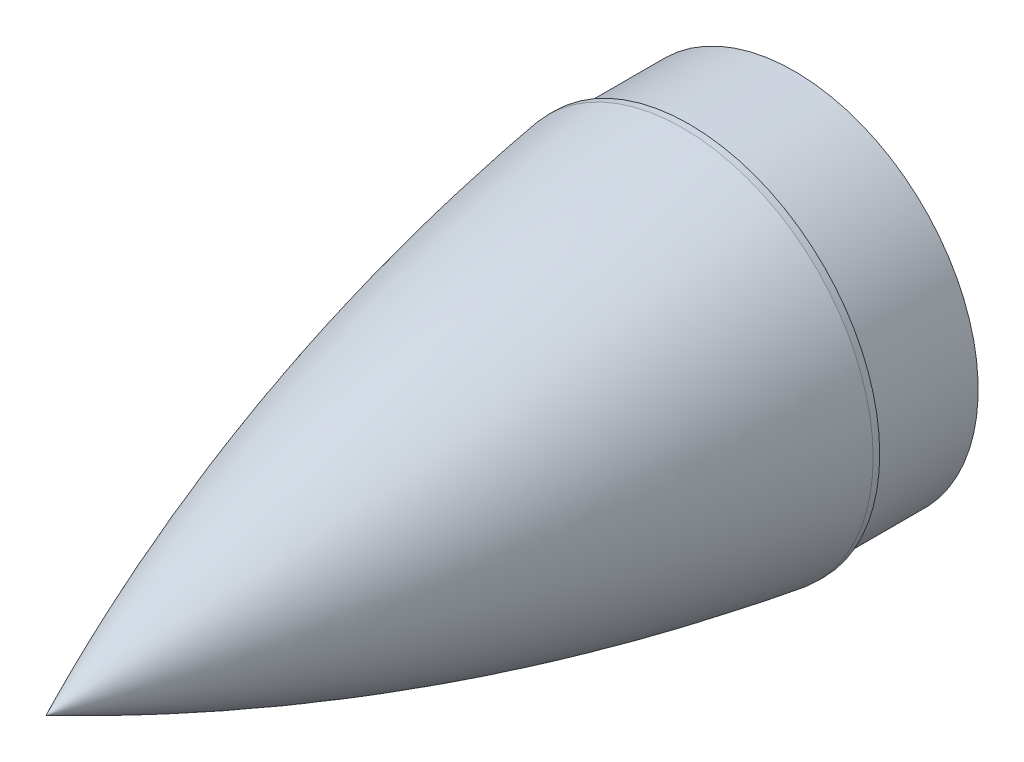
ISO-10303-21;
HEADER;
FILE_DESCRIPTION(('STEP AP214'),'2;1');
FILE_NAME('part.step','',(''),(''),'','','');
FILE_SCHEMA(('AUTOMOTIVE_DESIGN { 1 0 10303 214 1 1 1 1 }'));
ENDSEC;
DATA;
#1=APPLICATION_CONTEXT('core data for automotive mechanical design processes');
#2=APPLICATION_PROTOCOL_DEFINITION('international standard','automotive_design',2000,#1);
#3=PRODUCT_CONTEXT('',#1,'mechanical');
#4=PRODUCT('Part','Part','',(#3));
#5=PRODUCT_RELATED_PRODUCT_CATEGORY('part','',(#4));
#6=PRODUCT_DEFINITION_FORMATION('','',#4);
#7=PRODUCT_DEFINITION_CONTEXT('part definition',#1,'design');
#8=PRODUCT_DEFINITION('design','',#6,#7);
#9=PRODUCT_DEFINITION_SHAPE('','',#8);
#10=(LENGTH_UNIT() NAMED_UNIT(*) SI_UNIT(.MILLI.,.METRE.));
#11=(NAMED_UNIT(*) PLANE_ANGLE_UNIT() SI_UNIT($,.RADIAN.));
#12=(NAMED_UNIT(*) SI_UNIT($,.STERADIAN.) SOLID_ANGLE_UNIT());
#13=UNCERTAINTY_MEASURE_WITH_UNIT(LENGTH_MEASURE(1.E-05),#10,'distance_accuracy_value','');
#14=(GEOMETRIC_REPRESENTATION_CONTEXT(3) GLOBAL_UNCERTAINTY_ASSIGNED_CONTEXT((#13)) GLOBAL_UNIT_ASSIGNED_CONTEXT((#10,
#11,#12)) REPRESENTATION_CONTEXT('',''));
#15=CARTESIAN_POINT('',(0.,0.,0.));
#16=DIRECTION('',(0.,0.,1.));
#17=DIRECTION('',(1.,0.,0.));
#18=AXIS2_PLACEMENT_3D('',#15,#16,#17);
#19=CARTESIAN_POINT('',(0.,0.,-3.175));
#20=DIRECTION('',(0.,0.,1.));
#21=DIRECTION('',(1.,0.,0.));
#22=AXIS2_PLACEMENT_3D('',#19,#20,#21);
#23=CYLINDRICAL_SURFACE('',#22,92.075);
#24=CARTESIAN_POINT('',(0.,0.,-3.175));
#25=DIRECTION('',(0.,0.,1.));
#26=DIRECTION('',(1.,0.,0.));
#27=AXIS2_PLACEMENT_3D('',#24,#25,#26);
#28=CIRCLE('',#27,92.075);
#29=CARTESIAN_POINT('',(92.075,0.,-3.175));
#30=VERTEX_POINT('',#29);
#31=EDGE_CURVE('E93',#30,#30,#28,.T.);
#32=ORIENTED_EDGE('',*,*,#31,.T.);
#33=EDGE_LOOP('',(#32));
#34=FACE_BOUND('',#33,.T.);
#35=CARTESIAN_POINT('',(0.,0.,0.));
#36=DIRECTION('',(0.,0.,1.));
#37=DIRECTION('',(1.,0.,0.));
#38=AXIS2_PLACEMENT_3D('',#35,#36,#37);
#39=CIRCLE('',#38,92.075);
#40=CARTESIAN_POINT('',(92.075,0.,0.));
#41=VERTEX_POINT('',#40);
#42=EDGE_CURVE('E90',#41,#41,#39,.T.);
#43=ORIENTED_EDGE('',*,*,#42,.F.);
#44=EDGE_LOOP('',(#43));
#45=FACE_BOUND('',#44,.T.);
#46=ADVANCED_FACE('F36',(#34,#45),#23,.T.);
#47=CARTESIAN_POINT('',(0.,0.,-3.175));
#48=DIRECTION('',(0.,0.,1.));
#49=DIRECTION('',(1.,0.,0.));
#50=AXIS2_PLACEMENT_3D('',#47,#48,#49);
#51=PLANE('',#50);
#52=CARTESIAN_POINT('',(0.,0.,-3.175));
#53=DIRECTION('',(0.,0.,-1.));
#54=DIRECTION('',(-1.,0.,0.));
#55=AXIS2_PLACEMENT_3D('',#52,#53,#54);
#56=CIRCLE('',#55,88.9);
#57=CARTESIAN_POINT('',(-88.9,0.,-3.175));
#58=VERTEX_POINT('',#57);
#59=EDGE_CURVE('E44',#58,#58,#56,.T.);
#60=ORIENTED_EDGE('',*,*,#59,.F.);
#61=EDGE_LOOP('',(#60));
#62=FACE_BOUND('',#61,.T.);
#63=ORIENTED_EDGE('',*,*,#31,.F.);
#64=EDGE_LOOP('',(#63));
#65=FACE_BOUND('',#64,.T.);
#66=ADVANCED_FACE('F100',(#62,#65),#51,.F.);
#67=CARTESIAN_POINT('',(0.,0.,-53.975));
#68=DIRECTION('',(0.,0.,1.));
#69=DIRECTION('',(1.,0.,0.));
#70=AXIS2_PLACEMENT_3D('',#67,#68,#69);
#71=CYLINDRICAL_SURFACE('',#70,88.9);
#72=CARTESIAN_POINT('',(0.,0.,-53.975));
#73=DIRECTION('',(0.,0.,-1.));
#74=DIRECTION('',(-1.,0.,0.));
#75=AXIS2_PLACEMENT_3D('',#72,#73,#74);
#76=CIRCLE('',#75,88.9);
#77=CARTESIAN_POINT('',(-88.9,0.,-53.975));
#78=VERTEX_POINT('',#77);
#79=EDGE_CURVE('E84',#78,#78,#76,.T.);
#80=ORIENTED_EDGE('',*,*,#79,.F.);
#81=EDGE_LOOP('',(#80));
#82=FACE_BOUND('',#81,.T.);
#83=ORIENTED_EDGE('',*,*,#59,.T.);
#84=EDGE_LOOP('',(#83));
#85=FACE_BOUND('',#84,.T.);
#86=ADVANCED_FACE('F105',(#82,#85),#71,.T.);
#87=CARTESIAN_POINT('',(0.,0.,-53.975));
#88=DIRECTION('',(0.,0.,-1.));
#89=DIRECTION('',(-1.,0.,0.));
#90=AXIS2_PLACEMENT_3D('',#87,#88,#89);
#91=PLANE('',#90);
#92=CARTESIAN_POINT('',(0.,0.,-53.975));
#93=DIRECTION('',(0.,0.,-1.));
#94=DIRECTION('',(-1.,0.,0.));
#95=AXIS2_PLACEMENT_3D('',#92,#93,#94);
#96=CIRCLE('',#95,85.725);
#97=CARTESIAN_POINT('',(-85.725,0.,-53.975));
#98=VERTEX_POINT('',#97);
#99=EDGE_CURVE('E85',#98,#98,#96,.T.);
#100=ORIENTED_EDGE('',*,*,#99,.F.);
#101=EDGE_LOOP('',(#100));
#102=FACE_BOUND('',#101,.T.);
#103=ORIENTED_EDGE('',*,*,#79,.T.);
#104=EDGE_LOOP('',(#103));
#105=FACE_BOUND('',#104,.T.);
#106=ADVANCED_FACE('F113',(#102,#105),#91,.T.);
#107=CARTESIAN_POINT('',(0.,0.,-3.175));
#108=DIRECTION('',(0.,0.,-1.));
#109=DIRECTION('',(-1.,0.,0.));
#110=AXIS2_PLACEMENT_3D('',#107,#108,#109);
#111=CYLINDRICAL_SURFACE('',#110,85.725);
#112=CARTESIAN_POINT('',(0.,0.,-3.175));
#113=DIRECTION('',(0.,0.,-1.));
#114=DIRECTION('',(-1.,0.,0.));
#115=AXIS2_PLACEMENT_3D('',#112,#113,#114);
#116=CIRCLE('',#115,85.725);
#117=CARTESIAN_POINT('',(-85.725,0.,-3.175));
#118=VERTEX_POINT('',#117);
#119=EDGE_CURVE('E78',#118,#118,#116,.T.);
#120=ORIENTED_EDGE('',*,*,#119,.F.);
#121=EDGE_LOOP('',(#120));
#122=FACE_BOUND('',#121,.T.);
#123=ORIENTED_EDGE('',*,*,#99,.T.);
#124=EDGE_LOOP('',(#123));
#125=FACE_BOUND('',#124,.T.);
#126=ADVANCED_FACE('F119',(#122,#125),#111,.F.);
#127=CARTESIAN_POINT('',(0.,0.,-3.175));
#128=DIRECTION('',(0.,0.,-1.));
#129=DIRECTION('',(-1.,0.,0.));
#130=AXIS2_PLACEMENT_3D('',#127,#128,#129);
#131=PLANE('',#130);
#132=ORIENTED_EDGE('',*,*,#119,.T.);
#133=EDGE_LOOP('',(#132));
#134=FACE_BOUND('',#133,.T.);
#135=ADVANCED_FACE('F66',(#134),#131,.T.);
#136=CARTESIAN_POINT('',(0.,0.,307.975));
#137=CARTESIAN_POINT('',(68.5382612762219,0.,160.14302822329));
#138=CARTESIAN_POINT('',(92.075,0.,0.));
#139=B_SPLINE_CURVE_WITH_KNOTS('',2,(#136,#137,#138),.UNSPECIFIED.,.F.,.F.,(3,3),(0.,1.),.UNSPECIFIED.);
#140=CARTESIAN_POINT('',(0.,0.,0.));
#141=DIRECTION('',(0.,0.,-1.));
#142=AXIS1_PLACEMENT('',#140,#141);
#143=SURFACE_OF_REVOLUTION('',#139,#142);
#144=ORIENTED_EDGE('',*,*,#42,.T.);
#145=EDGE_LOOP('',(#144));
#146=FACE_BOUND('',#145,.T.);
#147=CARTESIAN_POINT('',(0.,0.,307.975));
#148=VERTEX_POINT('',#147);
#149=VERTEX_LOOP('',#148);
#150=FACE_BOUND('',#149,.T.);
#151=ADVANCED_FACE('F64',(#146,#150),#143,.T.);
#152=CLOSED_SHELL('',(#46,#66,#86,#106,#126,#135,#151));
#153=CARTESIAN_POINT('',(0.,0.,304.8));
#154=CARTESIAN_POINT('',(65.2775155158653,0.,157.994281662635));
#155=CARTESIAN_POINT('',(88.9,0.,0.));
#156=B_SPLINE_CURVE_WITH_KNOTS('',2,(#153,#154,#155),.UNSPECIFIED.,.F.,.F.,(3,3),(0.,1.),.UNSPECIFIED.);
#157=CARTESIAN_POINT('',(0.,0.,0.));
#158=DIRECTION('',(0.,0.,-1.));
#159=AXIS1_PLACEMENT('',#157,#158);
#160=SURFACE_OF_REVOLUTION('',#156,#159);
#161=CARTESIAN_POINT('',(0.,0.,0.));
#162=DIRECTION('',(0.,0.,-1.));
#163=DIRECTION('',(-1.,0.,0.));
#164=AXIS2_PLACEMENT_3D('',#161,#162,#163);
#165=CIRCLE('',#164,88.9);
#166=CARTESIAN_POINT('',(-88.9,0.,0.));
#167=VERTEX_POINT('',#166);
#168=EDGE_CURVE('E11',#167,#167,#165,.T.);
#169=ORIENTED_EDGE('',*,*,#168,.T.);
#170=EDGE_LOOP('',(#169));
#171=FACE_BOUND('',#170,.T.);
#172=CARTESIAN_POINT('',(0.,0.,304.8));
#173=VERTEX_POINT('',#172);
#174=VERTEX_LOOP('',#173);
#175=FACE_BOUND('',#174,.T.);
#176=ADVANCED_FACE('F50',(#171,#175),#160,.F.);
#177=CARTESIAN_POINT('',(0.,0.,0.));
#178=DIRECTION('',(0.,0.,1.));
#179=DIRECTION('',(1.,0.,0.));
#180=AXIS2_PLACEMENT_3D('',#177,#178,#179);
#181=PLANE('',#180);
#182=ORIENTED_EDGE('',*,*,#168,.F.);
#183=EDGE_LOOP('',(#182));
#184=FACE_BOUND('',#183,.T.);
#185=ADVANCED_FACE('F52',(#184),#181,.T.);
#186=CLOSED_SHELL('',(#176,#185));
#187=ORIENTED_CLOSED_SHELL('',*,#186,.T.);
#188=BREP_WITH_VOIDS('B2',#152,(#187));
#189=ADVANCED_BREP_SHAPE_REPRESENTATION('',(#18,#188),#14);
#190=SHAPE_DEFINITION_REPRESENTATION(#9,#189);
ENDSEC;
END-ISO-10303-21;
